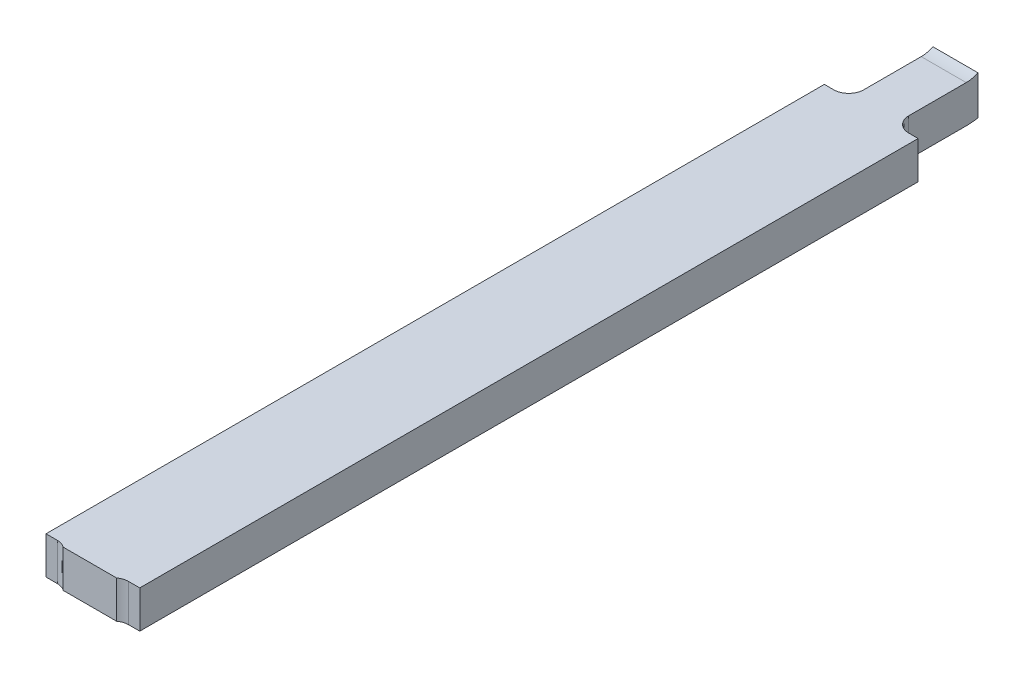
ISO-10303-21;
HEADER;
FILE_DESCRIPTION(('STEP AP214'),'2;1');
FILE_NAME('part.step','',(''),(''),'','','');
FILE_SCHEMA(('AUTOMOTIVE_DESIGN { 1 0 10303 214 1 1 1 1 }'));
ENDSEC;
DATA;
#1=APPLICATION_CONTEXT('core data for automotive mechanical design processes');
#2=APPLICATION_PROTOCOL_DEFINITION('international standard','automotive_design',2000,#1);
#3=PRODUCT_CONTEXT('',#1,'mechanical');
#4=PRODUCT('Part','Part','',(#3));
#5=PRODUCT_RELATED_PRODUCT_CATEGORY('part','',(#4));
#6=PRODUCT_DEFINITION_FORMATION('','',#4);
#7=PRODUCT_DEFINITION_CONTEXT('part definition',#1,'design');
#8=PRODUCT_DEFINITION('design','',#6,#7);
#9=PRODUCT_DEFINITION_SHAPE('','',#8);
#10=(LENGTH_UNIT() NAMED_UNIT(*) SI_UNIT(.MILLI.,.METRE.));
#11=(NAMED_UNIT(*) PLANE_ANGLE_UNIT() SI_UNIT($,.RADIAN.));
#12=(NAMED_UNIT(*) SI_UNIT($,.STERADIAN.) SOLID_ANGLE_UNIT());
#13=UNCERTAINTY_MEASURE_WITH_UNIT(LENGTH_MEASURE(1.E-05),#10,'distance_accuracy_value','');
#14=(GEOMETRIC_REPRESENTATION_CONTEXT(3) GLOBAL_UNCERTAINTY_ASSIGNED_CONTEXT((#13)) GLOBAL_UNIT_ASSIGNED_CONTEXT((#10,
#11,#12)) REPRESENTATION_CONTEXT('',''));
#15=CARTESIAN_POINT('',(0.,0.,0.));
#16=DIRECTION('',(0.,0.,1.));
#17=DIRECTION('',(1.,0.,0.));
#18=AXIS2_PLACEMENT_3D('',#15,#16,#17);
#19=CARTESIAN_POINT('',(-1.,-0.3652289464185,-7.500488855463));
#20=DIRECTION('',(0.,0.,1.));
#21=DIRECTION('',(1.,0.,0.));
#22=AXIS2_PLACEMENT_3D('',#19,#20,#21);
#23=PLANE('',#22);
#24=DIRECTION('',(0.,1.,0.));
#25=VECTOR('',#24,1.);
#26=CARTESIAN_POINT('',(-0.88,-0.3694122088881,-7.500488855463));
#27=LINE('',#26,#25);
#28=CARTESIAN_POINT('',(-0.88,-0.469296338681694,-7.50048885546298));
#29=VERTEX_POINT('',#28);
#30=CARTESIAN_POINT('',(-0.88,-0.261161554155171,-7.50048885546301));
#31=VERTEX_POINT('',#30);
#32=EDGE_CURVE('E150',#29,#31,#27,.T.);
#33=ORIENTED_EDGE('',*,*,#32,.F.);
#34=DIRECTION('',(-1.,0.,0.));
#35=VECTOR('',#34,1.);
#36=CARTESIAN_POINT('',(-0.874272716281,-0.469296338681697,-7.50048885546296));
#37=LINE('',#36,#35);
#38=CARTESIAN_POINT('',(-1.12,-0.469296338681694,-7.50048885546298));
#39=VERTEX_POINT('',#38);
#40=EDGE_CURVE('E139',#39,#29,#37,.F.);
#41=ORIENTED_EDGE('',*,*,#40,.F.);
#42=DIRECTION('',(0.,1.,0.));
#43=VECTOR('',#42,1.);
#44=CARTESIAN_POINT('',(-1.12,-0.3694122088881,-7.500488855463));
#45=LINE('',#44,#43);
#46=CARTESIAN_POINT('',(-1.12,-0.261161554155171,-7.50048885546301));
#47=VERTEX_POINT('',#46);
#48=EDGE_CURVE('E535',#39,#47,#45,.T.);
#49=ORIENTED_EDGE('',*,*,#48,.T.);
#50=DIRECTION('',(1.,0.,0.));
#51=VECTOR('',#50,1.);
#52=CARTESIAN_POINT('',(-1.125727283719,-0.261161554155164,-7.50048885546303));
#53=LINE('',#52,#51);
#54=EDGE_CURVE('E147',#47,#31,#53,.T.);
#55=ORIENTED_EDGE('',*,*,#54,.T.);
#56=EDGE_LOOP('',(#33,#41,#49,#55));
#57=FACE_BOUND('',#56,.T.);
#58=ADVANCED_FACE('F17',(#57),#23,.F.);
#59=CARTESIAN_POINT('',(-0.874272716281,-0.125,-7.43756007691));
#60=DIRECTION('',(-1.,0.,0.));
#61=DIRECTION('',(0.,0.,1.));
#62=AXIS2_PLACEMENT_3D('',#59,#60,#61);
#63=CYLINDRICAL_SURFACE('',#62,0.3499999999997);
#64=CARTESIAN_POINT('',(-1.12,-0.125,-7.43756007691));
#65=DIRECTION('',(-1.,0.,0.));
#66=DIRECTION('',(0.,0.,1.));
#67=AXIS2_PLACEMENT_3D('',#64,#65,#66);
#68=CIRCLE('',#67,0.3499999999997);
#69=CARTESIAN_POINT('',(-1.12,-0.475,-7.43756007691));
#70=VERTEX_POINT('',#69);
#71=EDGE_CURVE('E250',#70,#39,#68,.F.);
#72=ORIENTED_EDGE('',*,*,#71,.T.);
#73=ORIENTED_EDGE('',*,*,#40,.T.);
#74=CARTESIAN_POINT('',(-0.88,-0.125,-7.43756007691));
#75=DIRECTION('',(-1.,0.,0.));
#76=DIRECTION('',(0.,0.,1.));
#77=AXIS2_PLACEMENT_3D('',#74,#75,#76);
#78=CIRCLE('',#77,0.3499999999997);
#79=CARTESIAN_POINT('',(-0.88,-0.475,-7.43756007691));
#80=VERTEX_POINT('',#79);
#81=EDGE_CURVE('E274',#80,#29,#78,.F.);
#82=ORIENTED_EDGE('',*,*,#81,.F.);
#83=DIRECTION('',(1.,0.,0.));
#84=VECTOR('',#83,1.);
#85=CARTESIAN_POINT('',(-1.,-0.475,-7.43756007691));
#86=LINE('',#85,#84);
#87=EDGE_CURVE('E138',#80,#70,#86,.F.);
#88=ORIENTED_EDGE('',*,*,#87,.T.);
#89=EDGE_LOOP('',(#72,#73,#82,#88));
#90=FACE_BOUND('',#89,.T.);
#91=ADVANCED_FACE('F255',(#90),#63,.T.);
#92=CARTESIAN_POINT('',(-1.,-0.475,-5.160844573418));
#93=DIRECTION('',(0.,1.,0.));
#94=DIRECTION('',(0.,0.,1.));
#95=AXIS2_PLACEMENT_3D('',#92,#93,#94);
#96=PLANE('',#95);
#97=DIRECTION('',(1.,0.,0.));
#98=VECTOR('',#97,1.);
#99=CARTESIAN_POINT('',(-1.,-0.475,-2.9));
#100=LINE('',#99,#98);
#101=CARTESIAN_POINT('',(-1.25,-0.475,-2.9));
#102=VERTEX_POINT('',#101);
#103=CARTESIAN_POINT('',(-1.19,-0.475,-2.89999999999976));
#104=VERTEX_POINT('',#103);
#105=EDGE_CURVE('E118',#102,#104,#100,.T.);
#106=ORIENTED_EDGE('',*,*,#105,.F.);
#107=DIRECTION('',(0.,0.,-1.));
#108=VECTOR('',#107,1.);
#109=CARTESIAN_POINT('',(-1.25,-0.475,-4.975579331992));
#110=LINE('',#109,#108);
#111=CARTESIAN_POINT('',(-1.25,-0.475,-7.051158663985));
#112=VERTEX_POINT('',#111);
#113=EDGE_CURVE('E213',#102,#112,#110,.T.);
#114=ORIENTED_EDGE('',*,*,#113,.T.);
#115=DIRECTION('',(1.,0.,0.));
#116=VECTOR('',#115,1.);
#117=CARTESIAN_POINT('',(-1.225,-0.475,-7.051158663985));
#118=LINE('',#117,#116);
#119=CARTESIAN_POINT('',(-1.2,-0.475,-7.05115866398505));
#120=VERTEX_POINT('',#119);
#121=EDGE_CURVE('E218',#112,#120,#118,.T.);
#122=ORIENTED_EDGE('',*,*,#121,.T.);
#123=CARTESIAN_POINT('',(-1.11999999999968,-0.475,-7.131158663985));
#124=CARTESIAN_POINT('',(-1.12000887559487,-0.475,-7.12663228539965));
#125=CARTESIAN_POINT('',(-1.12039503047314,-0.475,-7.12211245444065));
#126=CARTESIAN_POINT('',(-1.12191562674134,-0.475,-7.11320506981296));
#127=CARTESIAN_POINT('',(-1.12304939310094,-0.475,-7.10881740054699));
#128=CARTESIAN_POINT('',(-1.12755618553399,-0.475,-7.09604021502536));
#129=CARTESIAN_POINT('',(-1.13203481865038,-0.475,-7.08801257629081));
#130=CARTESIAN_POINT('',(-1.14334118864262,-0.475,-7.07397145931296));
#131=CARTESIAN_POINT('',(-1.15014907486858,-0.475,-7.0679417819847));
#132=CARTESIAN_POINT('',(-1.16542981568029,-0.475,-7.05845747919417));
#133=CARTESIAN_POINT('',(-1.17391091624517,-0.475,-7.05501603051909));
#134=CARTESIAN_POINT('',(-1.18838450867066,-0.475,-7.05178938735803));
#135=CARTESIAN_POINT('',(-1.19419660039155,-0.475,-7.05114165155808));
#136=CARTESIAN_POINT('',(-1.2,-0.475,-7.05115866398511));
#137=B_SPLINE_CURVE_WITH_KNOTS('',3,(#123,#124,#125,#126,#127,#128,#129,#130,#131,#132,#133,
#134,#135,#136),.UNSPECIFIED.,.F.,.F.,(4,2,2,2,2,2,4),(0.,0.0135512792184498,0.0270903394941844,
0.0541002294468327,0.0808854407468497,0.107806110463926,0.125207976056705),.UNSPECIFIED.);
#138=CARTESIAN_POINT('',(-1.11999999999984,-0.475,-7.131158663985));
#139=VERTEX_POINT('',#138);
#140=EDGE_CURVE('E239',#139,#120,#137,.T.);
#141=ORIENTED_EDGE('',*,*,#140,.F.);
#142=DIRECTION('',(0.,0.,-1.));
#143=VECTOR('',#142,1.);
#144=CARTESIAN_POINT('',(-1.12,-0.475,-7.317732357319));
#145=LINE('',#144,#143);
#146=EDGE_CURVE('E537',#139,#70,#145,.T.);
#147=ORIENTED_EDGE('',*,*,#146,.T.);
#148=ORIENTED_EDGE('',*,*,#87,.F.);
#149=DIRECTION('',(0.,0.,-1.));
#150=VECTOR('',#149,1.);
#151=CARTESIAN_POINT('',(-0.88,-0.475,-7.317732357319));
#152=LINE('',#151,#150);
#153=CARTESIAN_POINT('',(-0.879999999999907,-0.475,-7.131158663985));
#154=VERTEX_POINT('',#153);
#155=EDGE_CURVE('E533',#154,#80,#152,.T.);
#156=ORIENTED_EDGE('',*,*,#155,.F.);
#157=CARTESIAN_POINT('',(-0.800000000000001,-0.475,-7.05115866398468));
#158=CARTESIAN_POINT('',(-0.804526378585375,-0.475,-7.05116753957989));
#159=CARTESIAN_POINT('',(-0.809046209544395,-0.475,-7.05155369445816));
#160=CARTESIAN_POINT('',(-0.817953594172134,-0.475,-7.05307429072637));
#161=CARTESIAN_POINT('',(-0.822341263438129,-0.475,-7.05420805708597));
#162=CARTESIAN_POINT('',(-0.835118448959828,-0.475,-7.05871484951906));
#163=CARTESIAN_POINT('',(-0.843146087694409,-0.475,-7.06319348263551));
#164=CARTESIAN_POINT('',(-0.857187204672276,-0.475,-7.07449985262786));
#165=CARTESIAN_POINT('',(-0.863216882000526,-0.475,-7.08130773885386));
#166=CARTESIAN_POINT('',(-0.872701184790983,-0.475,-7.09658847966563));
#167=CARTESIAN_POINT('',(-0.876142633466009,-0.475,-7.10506958023053));
#168=CARTESIAN_POINT('',(-0.879369276626939,-0.475,-7.11954317265591));
#169=CARTESIAN_POINT('',(-0.880017012426852,-0.475,-7.12535526437668));
#170=CARTESIAN_POINT('',(-0.879999999999813,-0.475,-7.131158663985));
#171=B_SPLINE_CURVE_WITH_KNOTS('',3,(#157,#158,#159,#160,#161,#162,#163,#164,#165,#166,#167,
#168,#169,#170),.UNSPECIFIED.,.F.,.F.,(4,2,2,2,2,2,4),(0.,0.013551279218524,0.027090339494328,
0.0541002294471316,0.0808854407472213,0.107806110464283,0.125207976056682),.UNSPECIFIED.);
#172=CARTESIAN_POINT('',(-0.8,-0.475,-7.05115866398484));
#173=VERTEX_POINT('',#172);
#174=EDGE_CURVE('E266',#173,#154,#171,.T.);
#175=ORIENTED_EDGE('',*,*,#174,.F.);
#176=DIRECTION('',(1.,0.,0.));
#177=VECTOR('',#176,1.);
#178=CARTESIAN_POINT('',(-0.775,-0.475,-7.051158663985));
#179=LINE('',#178,#177);
#180=CARTESIAN_POINT('',(-0.75,-0.475,-7.051158663985));
#181=VERTEX_POINT('',#180);
#182=EDGE_CURVE('E151',#173,#181,#179,.T.);
#183=ORIENTED_EDGE('',*,*,#182,.T.);
#184=DIRECTION('',(0.,0.,-1.));
#185=VECTOR('',#184,1.);
#186=CARTESIAN_POINT('',(-0.75,-0.475,-4.975579331992));
#187=LINE('',#186,#185);
#188=CARTESIAN_POINT('',(-0.75,-0.475,-2.9));
#189=VERTEX_POINT('',#188);
#190=EDGE_CURVE('E155',#189,#181,#187,.T.);
#191=ORIENTED_EDGE('',*,*,#190,.F.);
#192=DIRECTION('',(1.,0.,0.));
#193=VECTOR('',#192,1.);
#194=CARTESIAN_POINT('',(-0.78,-0.475,-2.9));
#195=LINE('',#194,#193);
#196=CARTESIAN_POINT('',(-0.81,-0.475,-2.89999999999989));
#197=VERTEX_POINT('',#196);
#198=EDGE_CURVE('E163',#197,#189,#195,.T.);
#199=ORIENTED_EDGE('',*,*,#198,.F.);
#200=CARTESIAN_POINT('',(-0.857824552421071,-0.475,-2.88412906992499));
#201=CARTESIAN_POINT('',(-0.85377977929517,-0.475,-2.88715347788669));
#202=CARTESIAN_POINT('',(-0.84944557417915,-0.475,-2.88978498732682));
#203=CARTESIAN_POINT('',(-0.840866305023749,-0.475,-2.8939430866675));
#204=CARTESIAN_POINT('',(-0.836664815891351,-0.475,-2.89555994023146));
#205=CARTESIAN_POINT('',(-0.828051190578895,-0.475,-2.89806057790434));
#206=CARTESIAN_POINT('',(-0.823639188951725,-0.475,-2.89894482380678));
#207=CARTESIAN_POINT('',(-0.816136365169778,-0.475,-2.89981357444955));
#208=CARTESIAN_POINT('',(-0.813067158432501,-0.475,-2.89999375978713));
#209=CARTESIAN_POINT('',(-0.809999999999999,-0.475,-2.89999999999978));
#210=B_SPLINE_CURVE_WITH_KNOTS('',3,(#200,#201,#202,#203,#204,#205,#206,#207,#208,#209),
.UNSPECIFIED.,.F.,.F.,(4,2,2,2,4),(0.,0.0151223248429862,0.0285648972656435,0.0419989898072054,
0.0512012871013705),.UNSPECIFIED.);
#211=CARTESIAN_POINT('',(-0.857824552421036,-0.475,-2.88412906992499));
#212=VERTEX_POINT('',#211);
#213=EDGE_CURVE('E125',#212,#197,#210,.T.);
#214=ORIENTED_EDGE('',*,*,#213,.F.);
#215=DIRECTION('',(1.,0.,0.));
#216=VECTOR('',#215,1.);
#217=CARTESIAN_POINT('',(-1.,-0.475,-2.884129069925));
#218=LINE('',#217,#216);
#219=CARTESIAN_POINT('',(-1.14217543362795,-0.475,-2.88412906992502));
#220=VERTEX_POINT('',#219);
#221=EDGE_CURVE('E129',#220,#212,#218,.T.);
#222=ORIENTED_EDGE('',*,*,#221,.F.);
#223=CARTESIAN_POINT('',(-1.19,-0.475,-2.89999999999952));
#224=CARTESIAN_POINT('',(-1.18496730361836,-0.475,-2.90001482409384));
#225=CARTESIAN_POINT('',(-1.17991815783308,-0.475,-2.89952557596737));
#226=CARTESIAN_POINT('',(-1.16614771604894,-0.475,-2.89686256447201));
#227=CARTESIAN_POINT('',(-1.15760052391877,-0.475,-2.89367998586962));
#228=CARTESIAN_POINT('',(-1.14719213429874,-0.475,-2.88765952253235));
#229=CARTESIAN_POINT('',(-1.14462559871613,-0.475,-2.88596721904185));
#230=CARTESIAN_POINT('',(-1.1421754336279,-0.475,-2.88412906992503));
#231=B_SPLINE_CURVE_WITH_KNOTS('',3,(#223,#224,#225,#226,#227,#228,#229,#230),.UNSPECIFIED.,.F.,
.F.,(4,2,2,4),(0.,0.0151178951010511,0.0419060489799044,0.0511063402020685),.UNSPECIFIED.);
#232=EDGE_CURVE('E20',#104,#220,#231,.T.);
#233=ORIENTED_EDGE('',*,*,#232,.F.);
#234=EDGE_LOOP('',(#106,#114,#122,#141,#147,#148,#156,#175,#183,#191,#199,#214,#222,#233));
#235=FACE_BOUND('',#234,.T.);
#236=ADVANCED_FACE('F135',(#235),#96,.F.);
#237=CARTESIAN_POINT('',(-0.807132391521,-0.269272716281,-2.899957930186));
#238=CARTESIAN_POINT('',(-0.8080873244825,-0.269272716281,-2.899988554812));
#239=CARTESIAN_POINT('',(-0.8142685123419,-0.269272716281,-2.900079343105));
#240=CARTESIAN_POINT('',(-0.825708586311,-0.269272716281,-2.898963559635));
#241=CARTESIAN_POINT('',(-0.840809082916,-0.269272716281,-2.894390814224));
#242=CARTESIAN_POINT('',(-0.8513126736996,-0.269272716281,-2.888776760997));
#243=CARTESIAN_POINT('',(-0.8582789768328,-0.269272716281,-2.883851645707));
#244=CARTESIAN_POINT('',(-0.8608479481388,-0.269272716281,-2.881786274905));
#245=CARTESIAN_POINT('',(-0.862294521887,-0.269272716281,-2.880535760883));
#246=(BOUNDED_CURVE() B_SPLINE_CURVE(3,(#237,#238,#239,#240,#241,#242,#243,#244,#245),
.UNSPECIFIED.,.F.,.F.) B_SPLINE_CURVE_WITH_KNOTS((4,1,1,1,1,1,4),(0.,0.04800761261446,
0.3103664664123,0.5726487803867,0.834938301322,0.9041878403021,1.),
.UNSPECIFIED.) CURVE() GEOMETRIC_REPRESENTATION_ITEM() RATIONAL_B_SPLINE_CURVE((1.,1.,1.,1.,1.,
1.,1.,1.,1.)) REPRESENTATION_ITEM(''));
#247=DIRECTION('',(0.,-1.,0.));
#248=VECTOR('',#247,1.);
#249=SURFACE_OF_LINEAR_EXTRUSION('',#246,#248);
#250=CARTESIAN_POINT('',(-0.857824555352463,-0.275,-2.88412906773645));
#251=CARTESIAN_POINT('',(-0.853779782365553,-0.275,-2.88715347588338));
#252=CARTESIAN_POINT('',(-0.84944557737009,-0.275,-2.88978498552229));
#253=CARTESIAN_POINT('',(-0.840866308406055,-0.275,-2.89394308525614));
#254=CARTESIAN_POINT('',(-0.836664819348663,-0.275,-2.89555993901262));
#255=CARTESIAN_POINT('',(-0.828051194151155,-0.275,-2.8980605770809));
#256=CARTESIAN_POINT('',(-0.823639192563839,-0.275,-2.89894482318585));
#257=CARTESIAN_POINT('',(-0.816136367607702,-0.275,-2.89981357430856));
#258=CARTESIAN_POINT('',(-0.813067159651325,-0.275,-2.89999375978683));
#259=CARTESIAN_POINT('',(-0.809999999999999,-0.275,-2.89999999999978));
#260=B_SPLINE_CURVE_WITH_KNOTS('',3,(#250,#251,#252,#253,#254,#255,#256,#257,#258,#259),
.UNSPECIFIED.,.F.,.F.,(4,2,2,2,4),(0.,0.0151223248428166,0.0285648972625773,0.0419989898081864,
0.0512012907536292),.UNSPECIFIED.);
#261=CARTESIAN_POINT('',(-0.857824553886732,-0.275,-2.88412906883072));
#262=VERTEX_POINT('',#261);
#263=CARTESIAN_POINT('',(-0.81,-0.275,-2.9));
#264=VERTEX_POINT('',#263);
#265=EDGE_CURVE('E132',#262,#264,#260,.T.);
#266=ORIENTED_EDGE('',*,*,#265,.F.);
#267=DIRECTION('',(0.,1.,0.));
#268=VECTOR('',#267,1.);
#269=CARTESIAN_POINT('',(-0.857824552421,-0.375,-2.884129069925));
#270=LINE('',#269,#268);
#271=EDGE_CURVE('E133',#212,#262,#270,.T.);
#272=ORIENTED_EDGE('',*,*,#271,.F.);
#273=ORIENTED_EDGE('',*,*,#213,.T.);
#274=DIRECTION('',(0.,1.,0.));
#275=VECTOR('',#274,1.);
#276=CARTESIAN_POINT('',(-0.81,-0.375,-2.9));
#277=LINE('',#276,#275);
#278=EDGE_CURVE('E166',#264,#197,#277,.F.);
#279=ORIENTED_EDGE('',*,*,#278,.F.);
#280=EDGE_LOOP('',(#266,#272,#273,#279));
#281=FACE_BOUND('',#280,.T.);
#282=ADVANCED_FACE('F254',(#281),#249,.T.);
#283=CARTESIAN_POINT('',(-0.78,-0.375,-2.9));
#284=DIRECTION('',(0.,0.,1.));
#285=DIRECTION('',(1.,0.,0.));
#286=AXIS2_PLACEMENT_3D('',#283,#284,#285);
#287=PLANE('',#286);
#288=DIRECTION('',(0.,1.,0.));
#289=VECTOR('',#288,1.);
#290=CARTESIAN_POINT('',(-0.75,-0.375,-2.9));
#291=LINE('',#290,#289);
#292=CARTESIAN_POINT('',(-0.75,-0.275,-2.9));
#293=VERTEX_POINT('',#292);
#294=EDGE_CURVE('E160',#293,#189,#291,.F.);
#295=ORIENTED_EDGE('',*,*,#294,.F.);
#296=DIRECTION('',(1.,0.,0.));
#297=VECTOR('',#296,1.);
#298=CARTESIAN_POINT('',(-1.,-0.275,-2.9));
#299=LINE('',#298,#297);
#300=EDGE_CURVE('E306',#264,#293,#299,.T.);
#301=ORIENTED_EDGE('',*,*,#300,.F.);
#302=ORIENTED_EDGE('',*,*,#278,.T.);
#303=ORIENTED_EDGE('',*,*,#198,.T.);
#304=EDGE_LOOP('',(#295,#301,#302,#303));
#305=FACE_BOUND('',#304,.T.);
#306=ADVANCED_FACE('F368',(#305),#287,.T.);
#307=CARTESIAN_POINT('',(-0.75,-0.375,-4.975579331992));
#308=DIRECTION('',(1.,0.,0.));
#309=DIRECTION('',(0.,0.,-1.));
#310=AXIS2_PLACEMENT_3D('',#307,#308,#309);
#311=PLANE('',#310);
#312=DIRECTION('',(0.,1.,0.));
#313=VECTOR('',#312,1.);
#314=CARTESIAN_POINT('',(-0.75,-0.375,-7.051158663985));
#315=LINE('',#314,#313);
#316=CARTESIAN_POINT('',(-0.75,-0.275,-7.051158663985));
#317=VERTEX_POINT('',#316);
#318=EDGE_CURVE('E154',#181,#317,#315,.T.);
#319=ORIENTED_EDGE('',*,*,#318,.T.);
#320=DIRECTION('',(0.,0.,1.));
#321=VECTOR('',#320,1.);
#322=CARTESIAN_POINT('',(-0.75,-0.275,-5.160844573418));
#323=LINE('',#322,#321);
#324=EDGE_CURVE('E302',#293,#317,#323,.F.);
#325=ORIENTED_EDGE('',*,*,#324,.F.);
#326=ORIENTED_EDGE('',*,*,#294,.T.);
#327=ORIENTED_EDGE('',*,*,#190,.T.);
#328=EDGE_LOOP('',(#319,#325,#326,#327));
#329=FACE_BOUND('',#328,.T.);
#330=ADVANCED_FACE('F373',(#329),#311,.T.);
#331=CARTESIAN_POINT('',(-0.775,-0.375,-7.051158663985));
#332=DIRECTION('',(0.,0.,1.));
#333=DIRECTION('',(1.,0.,0.));
#334=AXIS2_PLACEMENT_3D('',#331,#332,#333);
#335=PLANE('',#334);
#336=ORIENTED_EDGE('',*,*,#182,.F.);
#337=DIRECTION('',(0.,-1.,0.));
#338=VECTOR('',#337,1.);
#339=CARTESIAN_POINT('',(-0.800000000000001,-0.269272716281,-7.05115866398468));
#340=LINE('',#339,#338);
#341=CARTESIAN_POINT('',(-0.800000000000001,-0.275,-7.05115866398476));
#342=VERTEX_POINT('',#341);
#343=EDGE_CURVE('E273',#342,#173,#340,.T.);
#344=ORIENTED_EDGE('',*,*,#343,.F.);
#345=DIRECTION('',(1.,0.,0.));
#346=VECTOR('',#345,1.);
#347=CARTESIAN_POINT('',(-1.,-0.275,-7.051158663985));
#348=LINE('',#347,#346);
#349=EDGE_CURVE('E305',#317,#342,#348,.F.);
#350=ORIENTED_EDGE('',*,*,#349,.F.);
#351=ORIENTED_EDGE('',*,*,#318,.F.);
#352=EDGE_LOOP('',(#336,#344,#350,#351));
#353=FACE_BOUND('',#352,.T.);
#354=ADVANCED_FACE('F283',(#353),#335,.F.);
#355=CARTESIAN_POINT('',(-0.8799579295872,-0.269272716281,-7.134026291144));
#356=CARTESIAN_POINT('',(-0.879988554629,-0.269272716281,-7.133071351971));
#357=CARTESIAN_POINT('',(-0.8800793437147,-0.269272716281,-7.126890157897));
#358=CARTESIAN_POINT('',(-0.878963559635,-0.269272716281,-7.115450077674));
#359=CARTESIAN_POINT('',(-0.874390814224,-0.269272716281,-7.100349581069));
#360=CARTESIAN_POINT('',(-0.866951052025,-0.269272716281,-7.086430187272));
#361=CARTESIAN_POINT('',(-0.856931304376,-0.269272716281,-7.074236320435));
#362=CARTESIAN_POINT('',(-0.844737903504,-0.269272716281,-7.064213675467));
#363=CARTESIAN_POINT('',(-0.830816201624,-0.269272716281,-7.056770327068));
#364=CARTESIAN_POINT('',(-0.8157120404921,-0.269272716281,-7.05219575577));
#365=CARTESIAN_POINT('',(-0.8042704854036,-0.269272716281,-7.051079350384));
#366=CARTESIAN_POINT('',(-0.7980893207388,-0.269272716281,-7.051170096432));
#367=CARTESIAN_POINT('',(-0.7971353812591,-0.269272716281,-7.0512006723));
#368=(BOUNDED_CURVE() B_SPLINE_CURVE(3,(#355,#356,#357,#358,#359,#360,#361,#362,#363,#364,#365,
#366,#367),.UNSPECIFIED.,.F.,.F.) B_SPLINE_CURVE_WITH_KNOTS((4,1,1,1,1,1,1,1,1,1,4),(0.,
0.0218736690153,0.1414112381415,0.2609139337195,0.3804199129777,0.4999590271862,0.6195124003903,
0.7390518477019,0.8585895788749,0.9781493142556,1.),
.UNSPECIFIED.) CURVE() GEOMETRIC_REPRESENTATION_ITEM() RATIONAL_B_SPLINE_CURVE((1.,1.,1.,1.,1.,
1.,1.,1.,1.,1.,1.,1.,1.)) REPRESENTATION_ITEM(''));
#369=DIRECTION('',(0.,-1.,0.));
#370=VECTOR('',#369,1.);
#371=SURFACE_OF_LINEAR_EXTRUSION('',#368,#370);
#372=DIRECTION('',(0.,1.,0.));
#373=VECTOR('',#372,1.);
#374=CARTESIAN_POINT('',(-0.88,-0.3694122088881,-7.131158663985));
#375=LINE('',#374,#373);
#376=CARTESIAN_POINT('',(-0.87999999999995,-0.275,-7.131158663985));
#377=VERTEX_POINT('',#376);
#378=EDGE_CURVE('E272',#377,#154,#375,.F.);
#379=ORIENTED_EDGE('',*,*,#378,.F.);
#380=CARTESIAN_POINT('',(-0.800000000000001,-0.275,-7.05115866398468));
#381=CARTESIAN_POINT('',(-0.804526378585375,-0.275,-7.05116753957989));
#382=CARTESIAN_POINT('',(-0.809046209544395,-0.275,-7.05155369445816));
#383=CARTESIAN_POINT('',(-0.817953594172134,-0.275,-7.05307429072637));
#384=CARTESIAN_POINT('',(-0.822341263438129,-0.275,-7.05420805708597));
#385=CARTESIAN_POINT('',(-0.835118448959828,-0.275,-7.05871484951906));
#386=CARTESIAN_POINT('',(-0.843146087694409,-0.275,-7.06319348263551));
#387=CARTESIAN_POINT('',(-0.857187204672276,-0.275,-7.07449985262786));
#388=CARTESIAN_POINT('',(-0.863216882000526,-0.275,-7.08130773885386));
#389=CARTESIAN_POINT('',(-0.872701184790983,-0.275,-7.09658847966563));
#390=CARTESIAN_POINT('',(-0.876142633466009,-0.275,-7.10506958023053));
#391=CARTESIAN_POINT('',(-0.879369276626939,-0.275,-7.11954317265591));
#392=CARTESIAN_POINT('',(-0.880017012426852,-0.275,-7.12535526437668));
#393=CARTESIAN_POINT('',(-0.879999999999813,-0.275,-7.131158663985));
#394=B_SPLINE_CURVE_WITH_KNOTS('',3,(#380,#381,#382,#383,#384,#385,#386,#387,#388,#389,#390,
#391,#392,#393),.UNSPECIFIED.,.F.,.F.,(4,2,2,2,2,2,4),(0.,0.013551279218524,0.027090339494328,
0.0541002294471316,0.0808854407472213,0.107806110464283,0.12520797605668),.UNSPECIFIED.);
#395=EDGE_CURVE('E355',#342,#377,#394,.T.);
#396=ORIENTED_EDGE('',*,*,#395,.F.);
#397=ORIENTED_EDGE('',*,*,#343,.T.);
#398=ORIENTED_EDGE('',*,*,#174,.T.);
#399=EDGE_LOOP('',(#379,#396,#397,#398));
#400=FACE_BOUND('',#399,.T.);
#401=ADVANCED_FACE('F276',(#400),#371,.T.);
#402=CARTESIAN_POINT('',(-0.88,-0.3694122088881,-7.317732357319));
#403=DIRECTION('',(1.,0.,0.));
#404=DIRECTION('',(0.,0.,-1.));
#405=AXIS2_PLACEMENT_3D('',#402,#403,#404);
#406=PLANE('',#405);
#407=ORIENTED_EDGE('',*,*,#81,.T.);
#408=ORIENTED_EDGE('',*,*,#32,.T.);
#409=CARTESIAN_POINT('',(-0.88,-0.125,-7.437560076911));
#410=DIRECTION('',(1.,0.,0.));
#411=DIRECTION('',(0.,0.,-1.));
#412=AXIS2_PLACEMENT_3D('',#409,#410,#411);
#413=CIRCLE('',#412,0.15);
#414=CARTESIAN_POINT('',(-0.87999999999995,-0.275,-7.437560076911));
#415=VERTEX_POINT('',#414);
#416=EDGE_CURVE('E149',#31,#415,#413,.F.);
#417=ORIENTED_EDGE('',*,*,#416,.T.);
#418=DIRECTION('',(0.,0.,1.));
#419=VECTOR('',#418,1.);
#420=CARTESIAN_POINT('',(-0.8799999999999,-0.275,-5.160844573418));
#421=LINE('',#420,#419);
#422=EDGE_CURVE('E348',#377,#415,#421,.F.);
#423=ORIENTED_EDGE('',*,*,#422,.F.);
#424=ORIENTED_EDGE('',*,*,#378,.T.);
#425=ORIENTED_EDGE('',*,*,#155,.T.);
#426=EDGE_LOOP('',(#407,#408,#417,#423,#424,#425));
#427=FACE_BOUND('',#426,.T.);
#428=ADVANCED_FACE('F282',(#427),#406,.T.);
#429=CARTESIAN_POINT('',(-1.125727283719,-0.125,-7.437560076911));
#430=DIRECTION('',(1.,0.,0.));
#431=DIRECTION('',(0.,0.,-1.));
#432=AXIS2_PLACEMENT_3D('',#429,#430,#431);
#433=CYLINDRICAL_SURFACE('',#432,0.15);
#434=DIRECTION('',(1.,0.,0.));
#435=VECTOR('',#434,1.);
#436=CARTESIAN_POINT('',(-1.,-0.275,-7.437560076911));
#437=LINE('',#436,#435);
#438=CARTESIAN_POINT('',(-1.12,-0.275,-7.437560076911));
#439=VERTEX_POINT('',#438);
#440=EDGE_CURVE('E346',#415,#439,#437,.F.);
#441=ORIENTED_EDGE('',*,*,#440,.F.);
#442=ORIENTED_EDGE('',*,*,#416,.F.);
#443=ORIENTED_EDGE('',*,*,#54,.F.);
#444=CARTESIAN_POINT('',(-1.12,-0.125,-7.437560076911));
#445=DIRECTION('',(1.,0.,0.));
#446=DIRECTION('',(0.,0.,-1.));
#447=AXIS2_PLACEMENT_3D('',#444,#445,#446);
#448=CIRCLE('',#447,0.15);
#449=EDGE_CURVE('E536',#47,#439,#448,.F.);
#450=ORIENTED_EDGE('',*,*,#449,.T.);
#451=EDGE_LOOP('',(#441,#442,#443,#450));
#452=FACE_BOUND('',#451,.T.);
#453=ADVANCED_FACE('F443',(#452),#433,.F.);
#454=CARTESIAN_POINT('',(-1.12,-0.3694122088881,-7.317732357319));
#455=DIRECTION('',(1.,0.,0.));
#456=DIRECTION('',(0.,0.,-1.));
#457=AXIS2_PLACEMENT_3D('',#454,#455,#456);
#458=PLANE('',#457);
#459=ORIENTED_EDGE('',*,*,#146,.F.);
#460=DIRECTION('',(0.,-1.,0.));
#461=VECTOR('',#460,1.);
#462=CARTESIAN_POINT('',(-1.11999999999968,-0.269272716281,-7.131158663985));
#463=LINE('',#462,#461);
#464=CARTESIAN_POINT('',(-1.11999999999976,-0.275,-7.131158663985));
#465=VERTEX_POINT('',#464);
#466=EDGE_CURVE('E223',#465,#139,#463,.T.);
#467=ORIENTED_EDGE('',*,*,#466,.F.);
#468=DIRECTION('',(0.,0.,1.));
#469=VECTOR('',#468,1.);
#470=CARTESIAN_POINT('',(-1.12,-0.275,-5.160844573418));
#471=LINE('',#470,#469);
#472=EDGE_CURVE('E345',#439,#465,#471,.T.);
#473=ORIENTED_EDGE('',*,*,#472,.F.);
#474=ORIENTED_EDGE('',*,*,#449,.F.);
#475=ORIENTED_EDGE('',*,*,#48,.F.);
#476=ORIENTED_EDGE('',*,*,#71,.F.);
#477=EDGE_LOOP('',(#459,#467,#473,#474,#475,#476));
#478=FACE_BOUND('',#477,.T.);
#479=ADVANCED_FACE('F234',(#478),#458,.F.);
#480=CARTESIAN_POINT('',(-1.202867627159,-0.269272716281,-7.051200734398));
#481=CARTESIAN_POINT('',(-1.201912687986,-0.269272716281,-7.051170109356));
#482=CARTESIAN_POINT('',(-1.195731493912,-0.269272716281,-7.05107932027));
#483=CARTESIAN_POINT('',(-1.184291413689,-0.269272716281,-7.05219510435));
#484=CARTESIAN_POINT('',(-1.169190917084,-0.269272716281,-7.056767849761));
#485=CARTESIAN_POINT('',(-1.155271523287,-0.269272716281,-7.06420761196));
#486=CARTESIAN_POINT('',(-1.14307765645,-0.269272716281,-7.074227359609));
#487=CARTESIAN_POINT('',(-1.133055011482,-0.269272716281,-7.086420760481));
#488=CARTESIAN_POINT('',(-1.125611663083,-0.269272716281,-7.100342462361));
#489=CARTESIAN_POINT('',(-1.121037091785,-0.269272716281,-7.115446623493));
#490=CARTESIAN_POINT('',(-1.119920686399,-0.269272716281,-7.126888178581));
#491=CARTESIAN_POINT('',(-1.120011432447,-0.269272716281,-7.133069343246));
#492=CARTESIAN_POINT('',(-1.120042008315,-0.269272716281,-7.134023282726));
#493=(BOUNDED_CURVE() B_SPLINE_CURVE(3,(#480,#481,#482,#483,#484,#485,#486,#487,#488,#489,#490,
#491,#492),.UNSPECIFIED.,.F.,.F.) B_SPLINE_CURVE_WITH_KNOTS((4,1,1,1,1,1,1,1,1,1,4),(0.,
0.02187366901522,0.1414112381413,0.260913933719,0.380419912977,0.4999590271853,0.6195124003892,
0.7390518477007,0.8585895788734,0.9781493142558,1.),
.UNSPECIFIED.) CURVE() GEOMETRIC_REPRESENTATION_ITEM() RATIONAL_B_SPLINE_CURVE((1.,1.,1.,1.,1.,
1.,1.,1.,1.,1.,1.,1.,1.)) REPRESENTATION_ITEM(''));
#494=DIRECTION('',(0.,-1.,0.));
#495=VECTOR('',#494,1.);
#496=SURFACE_OF_LINEAR_EXTRUSION('',#493,#495);
#497=DIRECTION('',(0.,1.,0.));
#498=VECTOR('',#497,1.);
#499=CARTESIAN_POINT('',(-1.2,-0.375,-7.051158663985));
#500=LINE('',#499,#498);
#501=CARTESIAN_POINT('',(-1.2,-0.275,-7.051158663985));
#502=VERTEX_POINT('',#501);
#503=EDGE_CURVE('E216',#120,#502,#500,.T.);
#504=ORIENTED_EDGE('',*,*,#503,.T.);
#505=CARTESIAN_POINT('',(-1.11999999999968,-0.275,-7.131158663985));
#506=CARTESIAN_POINT('',(-1.12000887559487,-0.275,-7.12663228539965));
#507=CARTESIAN_POINT('',(-1.12039503047314,-0.275,-7.12211245444066));
#508=CARTESIAN_POINT('',(-1.12191562674134,-0.275,-7.11320506981297));
#509=CARTESIAN_POINT('',(-1.12304939310094,-0.275,-7.108817400547));
#510=CARTESIAN_POINT('',(-1.12755618553399,-0.275,-7.09604021502537));
#511=CARTESIAN_POINT('',(-1.13203481865037,-0.275,-7.08801257629082));
#512=CARTESIAN_POINT('',(-1.14334118864261,-0.275,-7.07397145931297));
#513=CARTESIAN_POINT('',(-1.15014907486856,-0.275,-7.06794178198472));
#514=CARTESIAN_POINT('',(-1.16542981568025,-0.275,-7.05845747919419));
#515=CARTESIAN_POINT('',(-1.17391091624513,-0.275,-7.0550160305191));
#516=CARTESIAN_POINT('',(-1.18838450867062,-0.275,-7.05178938735803));
#517=CARTESIAN_POINT('',(-1.19419660039153,-0.275,-7.05114165155808));
#518=CARTESIAN_POINT('',(-1.2,-0.275,-7.05115866398511));
#519=B_SPLINE_CURVE_WITH_KNOTS('',3,(#505,#506,#507,#508,#509,#510,#511,#512,#513,#514,#515,
#516,#517,#518),.UNSPECIFIED.,.F.,.F.,(4,2,2,2,2,2,4),(0.,0.0135512792184446,0.027090339494175,
0.0541002294468142,0.0808854407468176,0.107806110463871,0.125207976056706),.UNSPECIFIED.);
#520=EDGE_CURVE('E175',#465,#502,#519,.T.);
#521=ORIENTED_EDGE('',*,*,#520,.F.);
#522=ORIENTED_EDGE('',*,*,#466,.T.);
#523=ORIENTED_EDGE('',*,*,#140,.T.);
#524=EDGE_LOOP('',(#504,#521,#522,#523));
#525=FACE_BOUND('',#524,.T.);
#526=ADVANCED_FACE('F228',(#525),#496,.T.);
#527=CARTESIAN_POINT('',(-1.225,-0.375,-7.051158663985));
#528=DIRECTION('',(0.,0.,1.));
#529=DIRECTION('',(1.,0.,0.));
#530=AXIS2_PLACEMENT_3D('',#527,#528,#529);
#531=PLANE('',#530);
#532=ORIENTED_EDGE('',*,*,#121,.F.);
#533=DIRECTION('',(0.,1.,0.));
#534=VECTOR('',#533,1.);
#535=CARTESIAN_POINT('',(-1.25,-0.375,-7.051158663985));
#536=LINE('',#535,#534);
#537=CARTESIAN_POINT('',(-1.25,-0.275,-7.051158663985));
#538=VERTEX_POINT('',#537);
#539=EDGE_CURVE('E202',#112,#538,#536,.T.);
#540=ORIENTED_EDGE('',*,*,#539,.T.);
#541=DIRECTION('',(1.,0.,0.));
#542=VECTOR('',#541,1.);
#543=CARTESIAN_POINT('',(-1.,-0.275,-7.051158663985));
#544=LINE('',#543,#542);
#545=EDGE_CURVE('E208',#502,#538,#544,.F.);
#546=ORIENTED_EDGE('',*,*,#545,.F.);
#547=ORIENTED_EDGE('',*,*,#503,.F.);
#548=EDGE_LOOP('',(#532,#540,#546,#547));
#549=FACE_BOUND('',#548,.T.);
#550=ADVANCED_FACE('F233',(#549),#531,.F.);
#551=CARTESIAN_POINT('',(-1.25,-0.375,-4.975579331992));
#552=DIRECTION('',(1.,0.,0.));
#553=DIRECTION('',(0.,0.,-1.));
#554=AXIS2_PLACEMENT_3D('',#551,#552,#553);
#555=PLANE('',#554);
#556=ORIENTED_EDGE('',*,*,#113,.F.);
#557=DIRECTION('',(0.,1.,0.));
#558=VECTOR('',#557,1.);
#559=CARTESIAN_POINT('',(-1.25,-0.375,-2.9));
#560=LINE('',#559,#558);
#561=CARTESIAN_POINT('',(-1.25,-0.275,-2.9));
#562=VERTEX_POINT('',#561);
#563=EDGE_CURVE('E200',#562,#102,#560,.F.);
#564=ORIENTED_EDGE('',*,*,#563,.F.);
#565=DIRECTION('',(0.,0.,1.));
#566=VECTOR('',#565,1.);
#567=CARTESIAN_POINT('',(-1.25,-0.275,-5.160844573418));
#568=LINE('',#567,#566);
#569=EDGE_CURVE('E205',#538,#562,#568,.T.);
#570=ORIENTED_EDGE('',*,*,#569,.F.);
#571=ORIENTED_EDGE('',*,*,#539,.F.);
#572=EDGE_LOOP('',(#556,#564,#570,#571));
#573=FACE_BOUND('',#572,.T.);
#574=ADVANCED_FACE('F384',(#573),#555,.F.);
#575=CARTESIAN_POINT('',(-1.22,-0.375,-2.9));
#576=DIRECTION('',(0.,0.,1.));
#577=DIRECTION('',(1.,0.,0.));
#578=AXIS2_PLACEMENT_3D('',#575,#576,#577);
#579=PLANE('',#578);
#580=DIRECTION('',(0.,-1.,0.));
#581=VECTOR('',#580,1.);
#582=CARTESIAN_POINT('',(-1.19,-0.269272716281,-2.89999999999952));
#583=LINE('',#582,#581);
#584=CARTESIAN_POINT('',(-1.19,-0.275,-2.89999999999964));
#585=VERTEX_POINT('',#584);
#586=EDGE_CURVE('E122',#585,#104,#583,.T.);
#587=ORIENTED_EDGE('',*,*,#586,.F.);
#588=DIRECTION('',(1.,0.,0.));
#589=VECTOR('',#588,1.);
#590=CARTESIAN_POINT('',(-1.,-0.275,-2.9));
#591=LINE('',#590,#589);
#592=EDGE_CURVE('E174',#562,#585,#591,.T.);
#593=ORIENTED_EDGE('',*,*,#592,.F.);
#594=ORIENTED_EDGE('',*,*,#563,.T.);
#595=ORIENTED_EDGE('',*,*,#105,.T.);
#596=EDGE_LOOP('',(#587,#593,#594,#595));
#597=FACE_BOUND('',#596,.T.);
#598=ADVANCED_FACE('F188',(#597),#579,.T.);
#599=CARTESIAN_POINT('',(-1.137705468181,-0.269272716281,-2.880535754175));
#600=CARTESIAN_POINT('',(-1.139152040785,-0.269272716281,-2.881786269205));
#601=CARTESIAN_POINT('',(-1.141717902577,-0.269272716281,-2.88384914542));
#602=CARTESIAN_POINT('',(-1.148681761871,-0.269272716281,-2.888773339751));
#603=CARTESIAN_POINT('',(-1.159183798376,-0.269272716281,-2.894388336917));
#604=CARTESIAN_POINT('',(-1.174287959508,-0.269272716281,-2.898962908215));
#605=CARTESIAN_POINT('',(-1.185729509199,-0.269272716281,-2.900079313074));
#606=CARTESIAN_POINT('',(-1.191910668499,-0.269272716281,-2.89998856771));
#607=CARTESIAN_POINT('',(-1.192864602618,-0.269272716281,-2.899957992201));
#608=(BOUNDED_CURVE() B_SPLINE_CURVE(3,(#599,#600,#601,#602,#603,#604,#605,#606,#607),
.UNSPECIFIED.,.F.,.F.) B_SPLINE_CURVE_WITH_KNOTS((4,1,1,1,1,1,4),(0.,0.09581704921696,
0.1648704820857,0.4272468470588,0.6896194452896,0.952040340422,1.),
.UNSPECIFIED.) CURVE() GEOMETRIC_REPRESENTATION_ITEM() RATIONAL_B_SPLINE_CURVE((1.,1.,1.,1.,1.,
1.,1.,1.,1.)) REPRESENTATION_ITEM(''));
#609=DIRECTION('',(0.,-1.,0.));
#610=VECTOR('',#609,1.);
#611=SURFACE_OF_LINEAR_EXTRUSION('',#608,#610);
#612=ORIENTED_EDGE('',*,*,#232,.T.);
#613=DIRECTION('',(0.,1.,0.));
#614=VECTOR('',#613,1.);
#615=CARTESIAN_POINT('',(-1.142175433628,-0.375,-2.884129069925));
#616=LINE('',#615,#614);
#617=CARTESIAN_POINT('',(-1.142175433628,-0.275,-2.884129069925));
#618=VERTEX_POINT('',#617);
#619=EDGE_CURVE('E40',#618,#220,#616,.F.);
#620=ORIENTED_EDGE('',*,*,#619,.F.);
#621=CARTESIAN_POINT('',(-1.19,-0.275,-2.89999999999952));
#622=CARTESIAN_POINT('',(-1.18496730361583,-0.275,-2.90001482409393));
#623=CARTESIAN_POINT('',(-1.17991815783146,-0.275,-2.89952557596743));
#624=CARTESIAN_POINT('',(-1.16614771605181,-0.275,-2.89686256447191));
#625=CARTESIAN_POINT('',(-1.15760052392673,-0.275,-2.89367998586934));
#626=CARTESIAN_POINT('',(-1.14719213324626,-0.275,-2.88765952192525));
#627=CARTESIAN_POINT('',(-1.14462559668407,-0.275,-2.88596721770683));
#628=CARTESIAN_POINT('',(-1.1421754307146,-0.275,-2.88412906774999));
#629=B_SPLINE_CURVE_WITH_KNOTS('',3,(#621,#622,#623,#624,#625,#626,#627,#628),.UNSPECIFIED.,.F.,
.F.,(4,2,2,4),(0.,0.0151178951010511,0.0419060489799044,0.0511063438316891),.UNSPECIFIED.);
#630=EDGE_CURVE('E31',#585,#618,#629,.T.);
#631=ORIENTED_EDGE('',*,*,#630,.F.);
#632=ORIENTED_EDGE('',*,*,#586,.T.);
#633=EDGE_LOOP('',(#612,#620,#631,#632));
#634=FACE_BOUND('',#633,.T.);
#635=ADVANCED_FACE('F121',(#634),#611,.T.);
#636=CARTESIAN_POINT('',(-0.9999999930245,-0.375,-2.884129069925));
#637=DIRECTION('',(0.,0.,1.));
#638=DIRECTION('',(1.,0.,0.));
#639=AXIS2_PLACEMENT_3D('',#636,#637,#638);
#640=PLANE('',#639);
#641=ORIENTED_EDGE('',*,*,#619,.T.);
#642=ORIENTED_EDGE('',*,*,#221,.T.);
#643=ORIENTED_EDGE('',*,*,#271,.T.);
#644=DIRECTION('',(1.,0.,0.));
#645=VECTOR('',#644,1.);
#646=CARTESIAN_POINT('',(-1.,-0.275,-2.884129069925));
#647=LINE('',#646,#645);
#648=EDGE_CURVE('E11',#618,#262,#647,.T.);
#649=ORIENTED_EDGE('',*,*,#648,.F.);
#650=EDGE_LOOP('',(#641,#642,#643,#649));
#651=FACE_BOUND('',#650,.T.);
#652=ADVANCED_FACE('F127',(#651),#640,.T.);
#653=CARTESIAN_POINT('',(-1.,-0.275,-5.160844573418));
#654=DIRECTION('',(0.,1.,0.));
#655=DIRECTION('',(0.,0.,1.));
#656=AXIS2_PLACEMENT_3D('',#653,#654,#655);
#657=PLANE('',#656);
#658=ORIENTED_EDGE('',*,*,#630,.T.);
#659=ORIENTED_EDGE('',*,*,#648,.T.);
#660=ORIENTED_EDGE('',*,*,#265,.T.);
#661=ORIENTED_EDGE('',*,*,#300,.T.);
#662=ORIENTED_EDGE('',*,*,#324,.T.);
#663=ORIENTED_EDGE('',*,*,#349,.T.);
#664=ORIENTED_EDGE('',*,*,#395,.T.);
#665=ORIENTED_EDGE('',*,*,#422,.T.);
#666=ORIENTED_EDGE('',*,*,#440,.T.);
#667=ORIENTED_EDGE('',*,*,#472,.T.);
#668=ORIENTED_EDGE('',*,*,#520,.T.);
#669=ORIENTED_EDGE('',*,*,#545,.T.);
#670=ORIENTED_EDGE('',*,*,#569,.T.);
#671=ORIENTED_EDGE('',*,*,#592,.T.);
#672=EDGE_LOOP('',(#658,#659,#660,#661,#662,#663,#664,#665,#666,#667,#668,#669,#670,#671));
#673=FACE_BOUND('',#672,.T.);
#674=ADVANCED_FACE('F181',(#673),#657,.T.);
#675=CLOSED_SHELL('',(#58,#91,#236,#282,#306,#330,#354,#401,#428,#453,#479,#526,#550,#574,#598,
#635,#652,#674));
#676=MANIFOLD_SOLID_BREP('B1',#675);
#677=ADVANCED_BREP_SHAPE_REPRESENTATION('',(#18,#676),#14);
#678=SHAPE_DEFINITION_REPRESENTATION(#9,#677);
ENDSEC;
END-ISO-10303-21;
